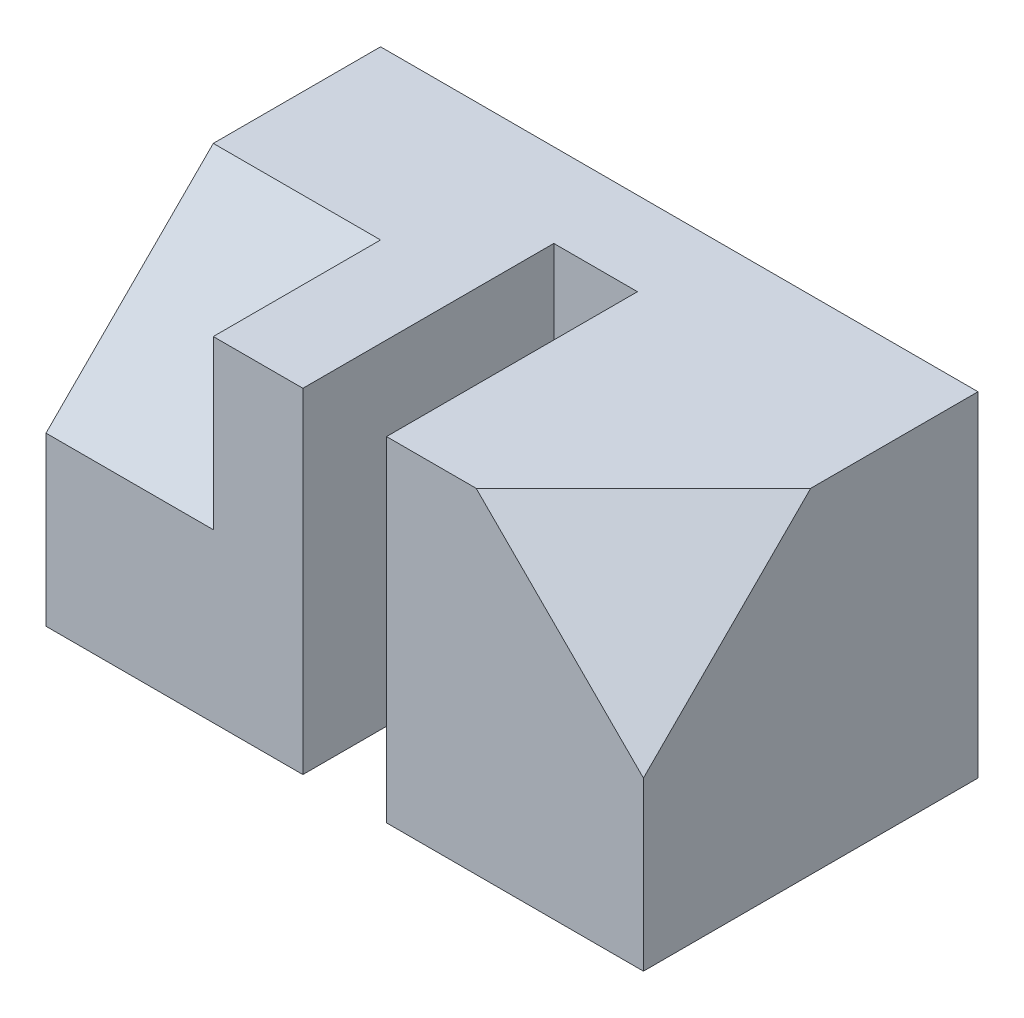
ISO-10303-21;
HEADER;
FILE_DESCRIPTION(('STEP AP214'),'2;1');
FILE_NAME('part.step','',(''),(''),'','','');
FILE_SCHEMA(('AUTOMOTIVE_DESIGN { 1 0 10303 214 1 1 1 1 }'));
ENDSEC;
DATA;
#1=APPLICATION_CONTEXT('core data for automotive mechanical design processes');
#2=APPLICATION_PROTOCOL_DEFINITION('international standard','automotive_design',2000,#1);
#3=PRODUCT_CONTEXT('',#1,'mechanical');
#4=PRODUCT('Part','Part','',(#3));
#5=PRODUCT_RELATED_PRODUCT_CATEGORY('part','',(#4));
#6=PRODUCT_DEFINITION_FORMATION('','',#4);
#7=PRODUCT_DEFINITION_CONTEXT('part definition',#1,'design');
#8=PRODUCT_DEFINITION('design','',#6,#7);
#9=PRODUCT_DEFINITION_SHAPE('','',#8);
#10=(LENGTH_UNIT() NAMED_UNIT(*) SI_UNIT(.MILLI.,.METRE.));
#11=(NAMED_UNIT(*) PLANE_ANGLE_UNIT() SI_UNIT($,.RADIAN.));
#12=(NAMED_UNIT(*) SI_UNIT($,.STERADIAN.) SOLID_ANGLE_UNIT());
#13=UNCERTAINTY_MEASURE_WITH_UNIT(LENGTH_MEASURE(1.E-05),#10,'distance_accuracy_value','');
#14=(GEOMETRIC_REPRESENTATION_CONTEXT(3) GLOBAL_UNCERTAINTY_ASSIGNED_CONTEXT((#13)) GLOBAL_UNIT_ASSIGNED_CONTEXT((#10,
#11,#12)) REPRESENTATION_CONTEXT('',''));
#15=CARTESIAN_POINT('',(0.,0.,0.));
#16=DIRECTION('',(0.,0.,1.));
#17=DIRECTION('',(1.,0.,0.));
#18=AXIS2_PLACEMENT_3D('',#15,#16,#17);
#19=CARTESIAN_POINT('',(25.,-14.,14.));
#20=DIRECTION('',(0.,0.,-1.));
#21=DIRECTION('',(-1.,0.,0.));
#22=AXIS2_PLACEMENT_3D('',#19,#20,#21);
#23=PLANE('',#22);
#24=DIRECTION('',(0.707106781186547,-0.707106781186547,0.));
#25=VECTOR('',#24,1.);
#26=CARTESIAN_POINT('',(32.,-7.00000000000001,14.));
#27=LINE('',#26,#25);
#28=CARTESIAN_POINT('',(11.,14.,14.));
#29=VERTEX_POINT('',#28);
#30=CARTESIAN_POINT('',(25.,0.,14.));
#31=VERTEX_POINT('',#30);
#32=EDGE_CURVE('E194',#29,#31,#27,.T.);
#33=ORIENTED_EDGE('',*,*,#32,.F.);
#34=DIRECTION('',(-1.,0.,0.));
#35=VECTOR('',#34,1.);
#36=CARTESIAN_POINT('',(25.,14.,14.));
#37=LINE('',#36,#35);
#38=CARTESIAN_POINT('',(3.5,14.,14.));
#39=VERTEX_POINT('',#38);
#40=EDGE_CURVE('E190',#29,#39,#37,.T.);
#41=ORIENTED_EDGE('',*,*,#40,.T.);
#42=DIRECTION('',(0.,1.,0.));
#43=VECTOR('',#42,1.);
#44=CARTESIAN_POINT('',(3.5,-14.,14.));
#45=LINE('',#44,#43);
#46=CARTESIAN_POINT('',(3.5,-14.,14.));
#47=VERTEX_POINT('',#46);
#48=EDGE_CURVE('E156',#47,#39,#45,.T.);
#49=ORIENTED_EDGE('',*,*,#48,.F.);
#50=DIRECTION('',(-1.,0.,0.));
#51=VECTOR('',#50,1.);
#52=CARTESIAN_POINT('',(25.,-14.,14.));
#53=LINE('',#52,#51);
#54=CARTESIAN_POINT('',(25.,-14.,14.));
#55=VERTEX_POINT('',#54);
#56=EDGE_CURVE('E186',#55,#47,#53,.T.);
#57=ORIENTED_EDGE('',*,*,#56,.F.);
#58=DIRECTION('',(0.,-1.,0.));
#59=VECTOR('',#58,1.);
#60=CARTESIAN_POINT('',(25.,-14.,14.));
#61=LINE('',#60,#59);
#62=EDGE_CURVE('E172',#31,#55,#61,.T.);
#63=ORIENTED_EDGE('',*,*,#62,.F.);
#64=EDGE_LOOP('',(#33,#41,#49,#57,#63));
#65=FACE_BOUND('',#64,.T.);
#66=ADVANCED_FACE('F33',(#65),#23,.F.);
#67=CARTESIAN_POINT('',(25.,-14.,-14.));
#68=DIRECTION('',(0.,0.,1.));
#69=DIRECTION('',(1.,0.,0.));
#70=AXIS2_PLACEMENT_3D('',#67,#68,#69);
#71=PLANE('',#70);
#72=DIRECTION('',(0.,1.,0.));
#73=VECTOR('',#72,1.);
#74=CARTESIAN_POINT('',(-25.,-14.,-14.));
#75=LINE('',#74,#73);
#76=CARTESIAN_POINT('',(-25.,-14.,-14.));
#77=VERTEX_POINT('',#76);
#78=CARTESIAN_POINT('',(-25.,14.,-14.));
#79=VERTEX_POINT('',#78);
#80=EDGE_CURVE('E159',#77,#79,#75,.T.);
#81=ORIENTED_EDGE('',*,*,#80,.T.);
#82=DIRECTION('',(-1.,0.,0.));
#83=VECTOR('',#82,1.);
#84=CARTESIAN_POINT('',(25.,14.,-14.));
#85=LINE('',#84,#83);
#86=CARTESIAN_POINT('',(25.,14.,-14.));
#87=VERTEX_POINT('',#86);
#88=EDGE_CURVE('E192',#87,#79,#85,.T.);
#89=ORIENTED_EDGE('',*,*,#88,.F.);
#90=DIRECTION('',(0.,1.,0.));
#91=VECTOR('',#90,1.);
#92=CARTESIAN_POINT('',(25.,-14.,-14.));
#93=LINE('',#92,#91);
#94=CARTESIAN_POINT('',(25.,-14.,-14.));
#95=VERTEX_POINT('',#94);
#96=EDGE_CURVE('E166',#95,#87,#93,.T.);
#97=ORIENTED_EDGE('',*,*,#96,.F.);
#98=DIRECTION('',(-1.,0.,0.));
#99=VECTOR('',#98,1.);
#100=CARTESIAN_POINT('',(25.,-14.,-14.));
#101=LINE('',#100,#99);
#102=EDGE_CURVE('E176',#95,#77,#101,.T.);
#103=ORIENTED_EDGE('',*,*,#102,.T.);
#104=EDGE_LOOP('',(#81,#89,#97,#103));
#105=FACE_BOUND('',#104,.T.);
#106=ADVANCED_FACE('F35',(#105),#71,.F.);
#107=CARTESIAN_POINT('',(25.,14.,14.));
#108=DIRECTION('',(0.,-1.,0.));
#109=DIRECTION('',(0.,0.,-1.));
#110=AXIS2_PLACEMENT_3D('',#107,#108,#109);
#111=PLANE('',#110);
#112=DIRECTION('',(0.,0.,1.));
#113=VECTOR('',#112,1.);
#114=CARTESIAN_POINT('',(-25.,14.,14.));
#115=LINE('',#114,#113);
#116=CARTESIAN_POINT('',(-25.,14.,0.));
#117=VERTEX_POINT('',#116);
#118=EDGE_CURVE('E132',#79,#117,#115,.T.);
#119=ORIENTED_EDGE('',*,*,#118,.T.);
#120=DIRECTION('',(-1.,0.,0.));
#121=VECTOR('',#120,1.);
#122=CARTESIAN_POINT('',(-11.,14.,0.));
#123=LINE('',#122,#121);
#124=CARTESIAN_POINT('',(-11.,14.,0.));
#125=VERTEX_POINT('',#124);
#126=EDGE_CURVE('E48',#125,#117,#123,.T.);
#127=ORIENTED_EDGE('',*,*,#126,.F.);
#128=DIRECTION('',(0.,0.,-1.));
#129=VECTOR('',#128,1.);
#130=CARTESIAN_POINT('',(-11.,14.,14.));
#131=LINE('',#130,#129);
#132=CARTESIAN_POINT('',(-11.,14.,14.));
#133=VERTEX_POINT('',#132);
#134=EDGE_CURVE('E120',#133,#125,#131,.T.);
#135=ORIENTED_EDGE('',*,*,#134,.F.);
#136=CARTESIAN_POINT('',(-3.5,14.,14.));
#137=VERTEX_POINT('',#136);
#138=EDGE_CURVE('E189',#137,#133,#37,.T.);
#139=ORIENTED_EDGE('',*,*,#138,.F.);
#140=DIRECTION('',(0.,0.,1.));
#141=VECTOR('',#140,1.);
#142=CARTESIAN_POINT('',(-3.5,14.,-7.));
#143=LINE('',#142,#141);
#144=CARTESIAN_POINT('',(-3.5,14.,-7.));
#145=VERTEX_POINT('',#144);
#146=EDGE_CURVE('E144',#145,#137,#143,.T.);
#147=ORIENTED_EDGE('',*,*,#146,.F.);
#148=DIRECTION('',(-1.,0.,0.));
#149=VECTOR('',#148,1.);
#150=CARTESIAN_POINT('',(3.5,14.,-7.));
#151=LINE('',#150,#149);
#152=CARTESIAN_POINT('',(3.5,14.,-7.));
#153=VERTEX_POINT('',#152);
#154=EDGE_CURVE('E141',#153,#145,#151,.T.);
#155=ORIENTED_EDGE('',*,*,#154,.F.);
#156=DIRECTION('',(0.,0.,-1.));
#157=VECTOR('',#156,1.);
#158=CARTESIAN_POINT('',(3.5,14.,-7.));
#159=LINE('',#158,#157);
#160=EDGE_CURVE('E134',#39,#153,#159,.T.);
#161=ORIENTED_EDGE('',*,*,#160,.F.);
#162=ORIENTED_EDGE('',*,*,#40,.F.);
#163=DIRECTION('',(-0.707106781186547,0.,0.707106781186547));
#164=VECTOR('',#163,1.);
#165=CARTESIAN_POINT('',(18.,14.,7.));
#166=LINE('',#165,#164);
#167=CARTESIAN_POINT('',(25.,14.,0.));
#168=VERTEX_POINT('',#167);
#169=EDGE_CURVE('E41',#168,#29,#166,.T.);
#170=ORIENTED_EDGE('',*,*,#169,.F.);
#171=DIRECTION('',(0.,0.,1.));
#172=VECTOR('',#171,1.);
#173=CARTESIAN_POINT('',(25.,14.,14.));
#174=LINE('',#173,#172);
#175=EDGE_CURVE('E169',#87,#168,#174,.T.);
#176=ORIENTED_EDGE('',*,*,#175,.F.);
#177=ORIENTED_EDGE('',*,*,#88,.T.);
#178=EDGE_LOOP('',(#119,#127,#135,#139,#147,#155,#161,#162,#170,#176,#177));
#179=FACE_BOUND('',#178,.T.);
#180=ADVANCED_FACE('F130',(#179),#111,.F.);
#181=DIRECTION('',(0.,1.,0.));
#182=VECTOR('',#181,1.);
#183=CARTESIAN_POINT('',(-11.,14.,14.));
#184=LINE('',#183,#182);
#185=CARTESIAN_POINT('',(-11.,0.,14.));
#186=VERTEX_POINT('',#185);
#187=EDGE_CURVE('E119',#186,#133,#184,.T.);
#188=ORIENTED_EDGE('',*,*,#187,.F.);
#189=DIRECTION('',(-1.,0.,0.));
#190=VECTOR('',#189,1.);
#191=CARTESIAN_POINT('',(-11.,0.,14.));
#192=LINE('',#191,#190);
#193=CARTESIAN_POINT('',(-25.,0.,14.));
#194=VERTEX_POINT('',#193);
#195=EDGE_CURVE('E116',#186,#194,#192,.T.);
#196=ORIENTED_EDGE('',*,*,#195,.T.);
#197=DIRECTION('',(0.,-1.,0.));
#198=VECTOR('',#197,1.);
#199=CARTESIAN_POINT('',(-25.,-14.,14.));
#200=LINE('',#199,#198);
#201=CARTESIAN_POINT('',(-25.,-14.,14.));
#202=VERTEX_POINT('',#201);
#203=EDGE_CURVE('E180',#194,#202,#200,.T.);
#204=ORIENTED_EDGE('',*,*,#203,.T.);
#205=CARTESIAN_POINT('',(-3.5,-14.,14.));
#206=VERTEX_POINT('',#205);
#207=EDGE_CURVE('E185',#206,#202,#53,.T.);
#208=ORIENTED_EDGE('',*,*,#207,.F.);
#209=DIRECTION('',(0.,1.,0.));
#210=VECTOR('',#209,1.);
#211=CARTESIAN_POINT('',(-3.5,-14.,14.));
#212=LINE('',#211,#210);
#213=EDGE_CURVE('E160',#206,#137,#212,.T.);
#214=ORIENTED_EDGE('',*,*,#213,.T.);
#215=ORIENTED_EDGE('',*,*,#138,.T.);
#216=EDGE_LOOP('',(#188,#196,#204,#208,#214,#215));
#217=FACE_BOUND('',#216,.T.);
#218=ADVANCED_FACE('F224',(#217),#23,.F.);
#219=CARTESIAN_POINT('',(25.,-14.,14.));
#220=DIRECTION('',(0.,1.,0.));
#221=DIRECTION('',(0.,0.,1.));
#222=AXIS2_PLACEMENT_3D('',#219,#220,#221);
#223=PLANE('',#222);
#224=ORIENTED_EDGE('',*,*,#56,.T.);
#225=DIRECTION('',(0.,0.,-1.));
#226=VECTOR('',#225,1.);
#227=CARTESIAN_POINT('',(3.5,-14.,-7.));
#228=LINE('',#227,#226);
#229=CARTESIAN_POINT('',(3.5,-14.,-7.));
#230=VERTEX_POINT('',#229);
#231=EDGE_CURVE('E146',#47,#230,#228,.T.);
#232=ORIENTED_EDGE('',*,*,#231,.T.);
#233=DIRECTION('',(-1.,0.,0.));
#234=VECTOR('',#233,1.);
#235=CARTESIAN_POINT('',(3.5,-14.,-7.));
#236=LINE('',#235,#234);
#237=CARTESIAN_POINT('',(-3.5,-14.,-7.));
#238=VERTEX_POINT('',#237);
#239=EDGE_CURVE('E149',#230,#238,#236,.T.);
#240=ORIENTED_EDGE('',*,*,#239,.T.);
#241=DIRECTION('',(0.,0.,1.));
#242=VECTOR('',#241,1.);
#243=CARTESIAN_POINT('',(-3.5,-14.,-7.));
#244=LINE('',#243,#242);
#245=EDGE_CURVE('E152',#238,#206,#244,.T.);
#246=ORIENTED_EDGE('',*,*,#245,.T.);
#247=ORIENTED_EDGE('',*,*,#207,.T.);
#248=DIRECTION('',(0.,0.,-1.));
#249=VECTOR('',#248,1.);
#250=CARTESIAN_POINT('',(-25.,-14.,14.));
#251=LINE('',#250,#249);
#252=EDGE_CURVE('E170',#202,#77,#251,.T.);
#253=ORIENTED_EDGE('',*,*,#252,.T.);
#254=ORIENTED_EDGE('',*,*,#102,.F.);
#255=DIRECTION('',(0.,0.,-1.));
#256=VECTOR('',#255,1.);
#257=CARTESIAN_POINT('',(25.,-14.,14.));
#258=LINE('',#257,#256);
#259=EDGE_CURVE('E174',#55,#95,#258,.T.);
#260=ORIENTED_EDGE('',*,*,#259,.F.);
#261=EDGE_LOOP('',(#224,#232,#240,#246,#247,#253,#254,#260));
#262=FACE_BOUND('',#261,.T.);
#263=ADVANCED_FACE('F210',(#262),#223,.F.);
#264=CARTESIAN_POINT('',(25.,0.,0.));
#265=DIRECTION('',(-1.,0.,0.));
#266=DIRECTION('',(0.,0.,1.));
#267=AXIS2_PLACEMENT_3D('',#264,#265,#266);
#268=PLANE('',#267);
#269=DIRECTION('',(0.,0.707106781186547,-0.707106781186547));
#270=VECTOR('',#269,1.);
#271=CARTESIAN_POINT('',(25.,7.,7.));
#272=LINE('',#271,#270);
#273=EDGE_CURVE('E11',#31,#168,#272,.T.);
#274=ORIENTED_EDGE('',*,*,#273,.F.);
#275=ORIENTED_EDGE('',*,*,#62,.T.);
#276=ORIENTED_EDGE('',*,*,#259,.T.);
#277=ORIENTED_EDGE('',*,*,#96,.T.);
#278=ORIENTED_EDGE('',*,*,#175,.T.);
#279=EDGE_LOOP('',(#274,#275,#276,#277,#278));
#280=FACE_BOUND('',#279,.T.);
#281=ADVANCED_FACE('F213',(#280),#268,.F.);
#282=CARTESIAN_POINT('',(-25.,0.,0.));
#283=DIRECTION('',(-1.,0.,0.));
#284=DIRECTION('',(0.,0.,1.));
#285=AXIS2_PLACEMENT_3D('',#282,#283,#284);
#286=PLANE('',#285);
#287=DIRECTION('',(0.,-0.707106781186547,0.707106781186548));
#288=VECTOR('',#287,1.);
#289=CARTESIAN_POINT('',(-25.,14.,0.));
#290=LINE('',#289,#288);
#291=EDGE_CURVE('E127',#117,#194,#290,.T.);
#292=ORIENTED_EDGE('',*,*,#291,.F.);
#293=ORIENTED_EDGE('',*,*,#118,.F.);
#294=ORIENTED_EDGE('',*,*,#80,.F.);
#295=ORIENTED_EDGE('',*,*,#252,.F.);
#296=ORIENTED_EDGE('',*,*,#203,.F.);
#297=EDGE_LOOP('',(#292,#293,#294,#295,#296));
#298=FACE_BOUND('',#297,.T.);
#299=ADVANCED_FACE('F221',(#298),#286,.T.);
#300=CARTESIAN_POINT('',(3.5,-14.,-7.));
#301=DIRECTION('',(1.,0.,0.));
#302=DIRECTION('',(0.,0.,-1.));
#303=AXIS2_PLACEMENT_3D('',#300,#301,#302);
#304=PLANE('',#303);
#305=DIRECTION('',(0.,1.,0.));
#306=VECTOR('',#305,1.);
#307=CARTESIAN_POINT('',(3.5,-14.,-7.));
#308=LINE('',#307,#306);
#309=EDGE_CURVE('E155',#230,#153,#308,.T.);
#310=ORIENTED_EDGE('',*,*,#309,.F.);
#311=ORIENTED_EDGE('',*,*,#231,.F.);
#312=ORIENTED_EDGE('',*,*,#48,.T.);
#313=ORIENTED_EDGE('',*,*,#160,.T.);
#314=EDGE_LOOP('',(#310,#311,#312,#313));
#315=FACE_BOUND('',#314,.T.);
#316=ADVANCED_FACE('F207',(#315),#304,.F.);
#317=CARTESIAN_POINT('',(-3.5,-14.,-7.));
#318=DIRECTION('',(-1.,0.,0.));
#319=DIRECTION('',(0.,0.,1.));
#320=AXIS2_PLACEMENT_3D('',#317,#318,#319);
#321=PLANE('',#320);
#322=ORIENTED_EDGE('',*,*,#213,.F.);
#323=ORIENTED_EDGE('',*,*,#245,.F.);
#324=DIRECTION('',(0.,1.,0.));
#325=VECTOR('',#324,1.);
#326=CARTESIAN_POINT('',(-3.5,-14.,-7.));
#327=LINE('',#326,#325);
#328=EDGE_CURVE('E163',#238,#145,#327,.T.);
#329=ORIENTED_EDGE('',*,*,#328,.T.);
#330=ORIENTED_EDGE('',*,*,#146,.T.);
#331=EDGE_LOOP('',(#322,#323,#329,#330));
#332=FACE_BOUND('',#331,.T.);
#333=ADVANCED_FACE('F228',(#332),#321,.F.);
#334=CARTESIAN_POINT('',(3.5,-14.,-7.));
#335=DIRECTION('',(0.,0.,-1.));
#336=DIRECTION('',(-1.,0.,0.));
#337=AXIS2_PLACEMENT_3D('',#334,#335,#336);
#338=PLANE('',#337);
#339=ORIENTED_EDGE('',*,*,#328,.F.);
#340=ORIENTED_EDGE('',*,*,#239,.F.);
#341=ORIENTED_EDGE('',*,*,#309,.T.);
#342=ORIENTED_EDGE('',*,*,#154,.T.);
#343=EDGE_LOOP('',(#339,#340,#341,#342));
#344=FACE_BOUND('',#343,.T.);
#345=ADVANCED_FACE('F231',(#344),#338,.F.);
#346=CARTESIAN_POINT('',(13.,13.,13.));
#347=DIRECTION('',(0.577350269189626,0.577350269189626,0.577350269189626));
#348=DIRECTION('',(0.707106781186547,0.,-0.707106781186547));
#349=AXIS2_PLACEMENT_3D('',#346,#347,#348);
#350=PLANE('',#349);
#351=ORIENTED_EDGE('',*,*,#169,.T.);
#352=ORIENTED_EDGE('',*,*,#32,.T.);
#353=ORIENTED_EDGE('',*,*,#273,.T.);
#354=EDGE_LOOP('',(#351,#352,#353));
#355=FACE_BOUND('',#354,.T.);
#356=ADVANCED_FACE('F199',(#355),#350,.T.);
#357=CARTESIAN_POINT('',(-11.,14.,0.));
#358=DIRECTION('',(0.,-0.707106781186548,-0.707106781186548));
#359=DIRECTION('',(0.,0.707106781186547,-0.707106781186548));
#360=AXIS2_PLACEMENT_3D('',#357,#358,#359);
#361=PLANE('',#360);
#362=ORIENTED_EDGE('',*,*,#291,.T.);
#363=ORIENTED_EDGE('',*,*,#195,.F.);
#364=DIRECTION('',(0.,-0.707106781186547,0.707106781186548));
#365=VECTOR('',#364,1.);
#366=CARTESIAN_POINT('',(-11.,14.,0.));
#367=LINE('',#366,#365);
#368=EDGE_CURVE('E112',#125,#186,#367,.T.);
#369=ORIENTED_EDGE('',*,*,#368,.F.);
#370=ORIENTED_EDGE('',*,*,#126,.T.);
#371=EDGE_LOOP('',(#362,#363,#369,#370));
#372=FACE_BOUND('',#371,.T.);
#373=ADVANCED_FACE('F114',(#372),#361,.F.);
#374=CARTESIAN_POINT('',(-11.,0.,0.));
#375=DIRECTION('',(-1.,0.,0.));
#376=DIRECTION('',(0.,0.,1.));
#377=AXIS2_PLACEMENT_3D('',#374,#375,#376);
#378=PLANE('',#377);
#379=ORIENTED_EDGE('',*,*,#134,.T.);
#380=ORIENTED_EDGE('',*,*,#368,.T.);
#381=ORIENTED_EDGE('',*,*,#187,.T.);
#382=EDGE_LOOP('',(#379,#380,#381));
#383=FACE_BOUND('',#382,.T.);
#384=ADVANCED_FACE('F123',(#383),#378,.T.);
#385=CLOSED_SHELL('',(#66,#106,#180,#218,#263,#281,#299,#316,#333,#345,#356,#373,#384));
#386=MANIFOLD_SOLID_BREP('B2',#385);
#387=ADVANCED_BREP_SHAPE_REPRESENTATION('',(#18,#386),#14);
#388=SHAPE_DEFINITION_REPRESENTATION(#9,#387);
ENDSEC;
END-ISO-10303-21;
